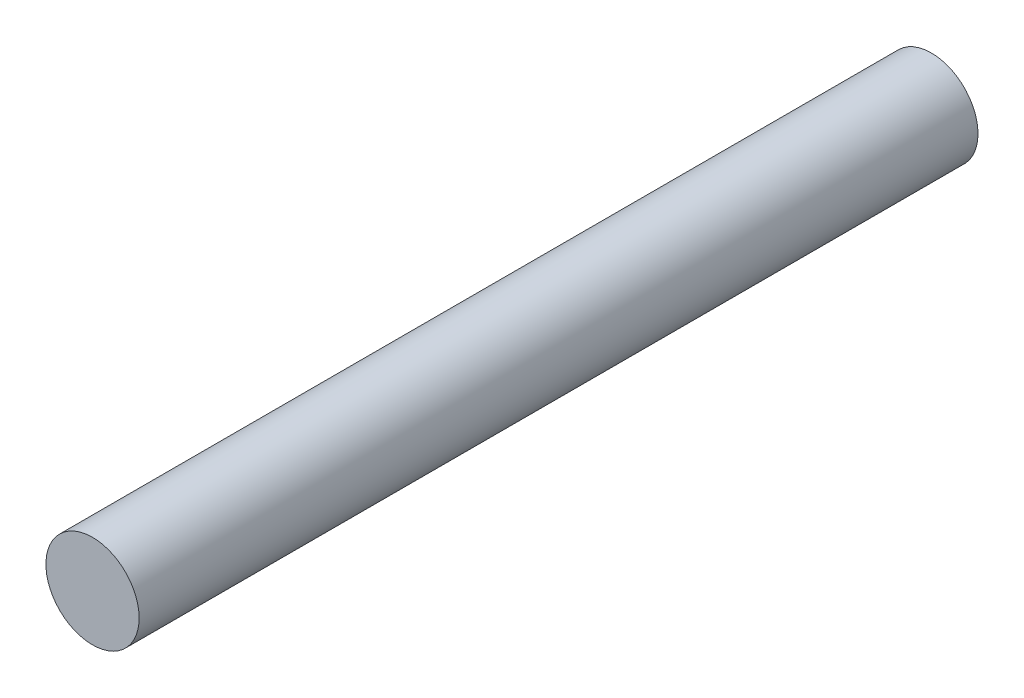
ISO-10303-21;
HEADER;
FILE_DESCRIPTION(('STEP AP214'),'2;1');
FILE_NAME('part.step','',(''),(''),'','','');
FILE_SCHEMA(('AUTOMOTIVE_DESIGN { 1 0 10303 214 1 1 1 1 }'));
ENDSEC;
DATA;
#1=APPLICATION_CONTEXT('core data for automotive mechanical design processes');
#2=APPLICATION_PROTOCOL_DEFINITION('international standard','automotive_design',2000,#1);
#3=PRODUCT_CONTEXT('',#1,'mechanical');
#4=PRODUCT('Part','Part','',(#3));
#5=PRODUCT_RELATED_PRODUCT_CATEGORY('part','',(#4));
#6=PRODUCT_DEFINITION_FORMATION('','',#4);
#7=PRODUCT_DEFINITION_CONTEXT('part definition',#1,'design');
#8=PRODUCT_DEFINITION('design','',#6,#7);
#9=PRODUCT_DEFINITION_SHAPE('','',#8);
#10=(LENGTH_UNIT() NAMED_UNIT(*) SI_UNIT(.MILLI.,.METRE.));
#11=(NAMED_UNIT(*) PLANE_ANGLE_UNIT() SI_UNIT($,.RADIAN.));
#12=(NAMED_UNIT(*) SI_UNIT($,.STERADIAN.) SOLID_ANGLE_UNIT());
#13=UNCERTAINTY_MEASURE_WITH_UNIT(LENGTH_MEASURE(1.E-05),#10,'distance_accuracy_value','');
#14=(GEOMETRIC_REPRESENTATION_CONTEXT(3) GLOBAL_UNCERTAINTY_ASSIGNED_CONTEXT((#13)) GLOBAL_UNIT_ASSIGNED_CONTEXT((#10,
#11,#12)) REPRESENTATION_CONTEXT('',''));
#15=CARTESIAN_POINT('',(0.,0.,0.));
#16=DIRECTION('',(0.,0.,1.));
#17=DIRECTION('',(1.,0.,0.));
#18=AXIS2_PLACEMENT_3D('',#15,#16,#17);
#19=CARTESIAN_POINT('',(3.976,-4.501,-9.1));
#20=DIRECTION('',(0.,0.,-1.));
#21=DIRECTION('',(-1.,0.,0.));
#22=AXIS2_PLACEMENT_3D('',#19,#20,#21);
#23=PLANE('',#22);
#24=CARTESIAN_POINT('',(3.675,-4.2,-9.1));
#25=DIRECTION('',(0.,0.,1.));
#26=DIRECTION('',(1.,0.,0.));
#27=AXIS2_PLACEMENT_3D('',#24,#25,#26);
#28=CIRCLE('',#27,0.3);
#29=CARTESIAN_POINT('',(3.975,-4.2,-9.1));
#30=VERTEX_POINT('',#29);
#31=EDGE_CURVE('E19',#30,#30,#28,.T.);
#32=ORIENTED_EDGE('',*,*,#31,.F.);
#33=EDGE_LOOP('',(#32));
#34=FACE_BOUND('',#33,.T.);
#35=ADVANCED_FACE('F15',(#34),#23,.T.);
#36=CARTESIAN_POINT('',(3.675,-4.2,-9.1));
#37=DIRECTION('',(0.,0.,1.));
#38=DIRECTION('',(1.,0.,0.));
#39=AXIS2_PLACEMENT_3D('',#36,#37,#38);
#40=CYLINDRICAL_SURFACE('',#39,0.3);
#41=CARTESIAN_POINT('',(3.675,-4.2,-3.7));
#42=DIRECTION('',(0.,0.,1.));
#43=DIRECTION('',(1.,0.,0.));
#44=AXIS2_PLACEMENT_3D('',#41,#42,#43);
#45=CIRCLE('',#44,0.3);
#46=CARTESIAN_POINT('',(3.975,-4.2,-3.7));
#47=VERTEX_POINT('',#46);
#48=EDGE_CURVE('E10',#47,#47,#45,.T.);
#49=ORIENTED_EDGE('',*,*,#48,.F.);
#50=EDGE_LOOP('',(#49));
#51=FACE_BOUND('',#50,.T.);
#52=ORIENTED_EDGE('',*,*,#31,.T.);
#53=EDGE_LOOP('',(#52));
#54=FACE_BOUND('',#53,.T.);
#55=ADVANCED_FACE('F28',(#51,#54),#40,.T.);
#56=CARTESIAN_POINT('',(3.976,-3.899,-3.7));
#57=DIRECTION('',(0.,0.,1.));
#58=DIRECTION('',(-1.,0.,0.));
#59=AXIS2_PLACEMENT_3D('',#56,#57,#58);
#60=PLANE('',#59);
#61=ORIENTED_EDGE('',*,*,#48,.T.);
#62=EDGE_LOOP('',(#61));
#63=FACE_BOUND('',#62,.T.);
#64=ADVANCED_FACE('F17',(#63),#60,.T.);
#65=CLOSED_SHELL('',(#35,#55,#64));
#66=MANIFOLD_SOLID_BREP('B1',#65);
#67=ADVANCED_BREP_SHAPE_REPRESENTATION('',(#18,#66),#14);
#68=SHAPE_DEFINITION_REPRESENTATION(#9,#67);
ENDSEC;
END-ISO-10303-21;
